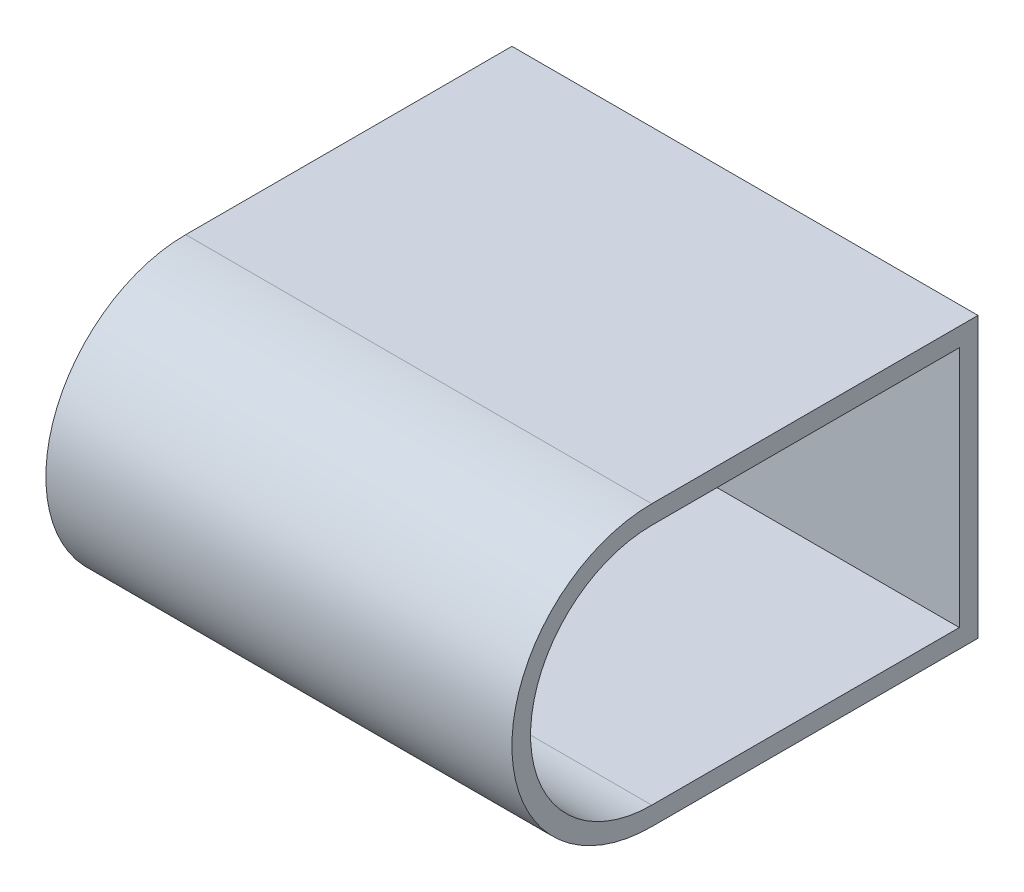
ISO-10303-21;
HEADER;
FILE_DESCRIPTION(('STEP AP214'),'2;1');
FILE_NAME('part.step','',(''),(''),'','','');
FILE_SCHEMA(('AUTOMOTIVE_DESIGN { 1 0 10303 214 1 1 1 1 }'));
ENDSEC;
DATA;
#1=APPLICATION_CONTEXT('core data for automotive mechanical design processes');
#2=APPLICATION_PROTOCOL_DEFINITION('international standard','automotive_design',2000,#1);
#3=PRODUCT_CONTEXT('',#1,'mechanical');
#4=PRODUCT('Part','Part','',(#3));
#5=PRODUCT_RELATED_PRODUCT_CATEGORY('part','',(#4));
#6=PRODUCT_DEFINITION_FORMATION('','',#4);
#7=PRODUCT_DEFINITION_CONTEXT('part definition',#1,'design');
#8=PRODUCT_DEFINITION('design','',#6,#7);
#9=PRODUCT_DEFINITION_SHAPE('','',#8);
#10=(LENGTH_UNIT() NAMED_UNIT(*) SI_UNIT(.MILLI.,.METRE.));
#11=(NAMED_UNIT(*) PLANE_ANGLE_UNIT() SI_UNIT($,.RADIAN.));
#12=(NAMED_UNIT(*) SI_UNIT($,.STERADIAN.) SOLID_ANGLE_UNIT());
#13=UNCERTAINTY_MEASURE_WITH_UNIT(LENGTH_MEASURE(1.E-05),#10,'distance_accuracy_value','');
#14=(GEOMETRIC_REPRESENTATION_CONTEXT(3) GLOBAL_UNCERTAINTY_ASSIGNED_CONTEXT((#13)) GLOBAL_UNIT_ASSIGNED_CONTEXT((#10,
#11,#12)) REPRESENTATION_CONTEXT('',''));
#15=CARTESIAN_POINT('',(0.,0.,0.));
#16=DIRECTION('',(0.,0.,1.));
#17=DIRECTION('',(1.,0.,0.));
#18=AXIS2_PLACEMENT_3D('',#15,#16,#17);
#19=CARTESIAN_POINT('',(2.,0.,35.));
#20=DIRECTION('',(-1.,0.,0.));
#21=DIRECTION('',(0.,0.,1.));
#22=AXIS2_PLACEMENT_3D('',#19,#20,#21);
#23=CYLINDRICAL_SURFACE('',#22,13.);
#24=CARTESIAN_POINT('',(0.,0.,35.));
#25=DIRECTION('',(-1.,0.,0.));
#26=DIRECTION('',(0.,0.,1.));
#27=AXIS2_PLACEMENT_3D('',#24,#25,#26);
#28=CIRCLE('',#27,13.);
#29=CARTESIAN_POINT('',(0.,-13.,35.));
#30=VERTEX_POINT('',#29);
#31=CARTESIAN_POINT('',(0.,13.,35.));
#32=VERTEX_POINT('',#31);
#33=EDGE_CURVE('E124',#30,#32,#28,.T.);
#34=ORIENTED_EDGE('',*,*,#33,.F.);
#35=DIRECTION('',(-1.,0.,0.));
#36=VECTOR('',#35,1.);
#37=CARTESIAN_POINT('',(2.,-13.,35.));
#38=LINE('',#37,#36);
#39=CARTESIAN_POINT('',(2.,-13.,35.));
#40=VERTEX_POINT('',#39);
#41=EDGE_CURVE('E13',#40,#30,#38,.T.);
#42=ORIENTED_EDGE('',*,*,#41,.F.);
#43=CARTESIAN_POINT('',(2.,0.,35.));
#44=DIRECTION('',(-1.,0.,0.));
#45=DIRECTION('',(0.,0.,1.));
#46=AXIS2_PLACEMENT_3D('',#43,#44,#45);
#47=CIRCLE('',#46,13.);
#48=CARTESIAN_POINT('',(2.,13.,35.));
#49=VERTEX_POINT('',#48);
#50=EDGE_CURVE('E117',#40,#49,#47,.T.);
#51=ORIENTED_EDGE('',*,*,#50,.T.);
#52=DIRECTION('',(-1.,0.,0.));
#53=VECTOR('',#52,1.);
#54=CARTESIAN_POINT('',(2.,13.,35.));
#55=LINE('',#54,#53);
#56=EDGE_CURVE('E62',#49,#32,#55,.T.);
#57=ORIENTED_EDGE('',*,*,#56,.T.);
#58=EDGE_LOOP('',(#34,#42,#51,#57));
#59=FACE_BOUND('',#58,.T.);
#60=ADVANCED_FACE('F59',(#59),#23,.T.);
#61=CARTESIAN_POINT('',(2.,-13.,35.));
#62=DIRECTION('',(0.,-1.,0.));
#63=DIRECTION('',(0.,0.,-1.));
#64=AXIS2_PLACEMENT_3D('',#61,#62,#63);
#65=PLANE('',#64);
#66=DIRECTION('',(0.,0.,1.));
#67=VECTOR('',#66,1.);
#68=CARTESIAN_POINT('',(0.,-13.,35.));
#69=LINE('',#68,#67);
#70=CARTESIAN_POINT('',(0.,-13.,2.));
#71=VERTEX_POINT('',#70);
#72=EDGE_CURVE('E119',#71,#30,#69,.T.);
#73=ORIENTED_EDGE('',*,*,#72,.F.);
#74=DIRECTION('',(-1.,0.,0.));
#75=VECTOR('',#74,1.);
#76=CARTESIAN_POINT('',(2.,-13.,2.));
#77=LINE('',#76,#75);
#78=CARTESIAN_POINT('',(2.,-13.,2.));
#79=VERTEX_POINT('',#78);
#80=EDGE_CURVE('E68',#79,#71,#77,.T.);
#81=ORIENTED_EDGE('',*,*,#80,.F.);
#82=DIRECTION('',(0.,0.,1.));
#83=VECTOR('',#82,1.);
#84=CARTESIAN_POINT('',(2.,-13.,35.));
#85=LINE('',#84,#83);
#86=EDGE_CURVE('E114',#79,#40,#85,.T.);
#87=ORIENTED_EDGE('',*,*,#86,.T.);
#88=ORIENTED_EDGE('',*,*,#41,.T.);
#89=EDGE_LOOP('',(#73,#81,#87,#88));
#90=FACE_BOUND('',#89,.T.);
#91=ADVANCED_FACE('F135',(#90),#65,.T.);
#92=CARTESIAN_POINT('',(2.,-13.,2.));
#93=DIRECTION('',(0.,0.,-1.));
#94=DIRECTION('',(-1.,0.,0.));
#95=AXIS2_PLACEMENT_3D('',#92,#93,#94);
#96=PLANE('',#95);
#97=DIRECTION('',(0.,-1.,0.));
#98=VECTOR('',#97,1.);
#99=CARTESIAN_POINT('',(0.,-13.,2.));
#100=LINE('',#99,#98);
#101=CARTESIAN_POINT('',(0.,13.,2.));
#102=VERTEX_POINT('',#101);
#103=EDGE_CURVE('E109',#102,#71,#100,.T.);
#104=ORIENTED_EDGE('',*,*,#103,.F.);
#105=DIRECTION('',(-1.,0.,0.));
#106=VECTOR('',#105,1.);
#107=CARTESIAN_POINT('',(2.,13.,2.));
#108=LINE('',#107,#106);
#109=CARTESIAN_POINT('',(2.,13.,2.));
#110=VERTEX_POINT('',#109);
#111=EDGE_CURVE('E104',#110,#102,#108,.T.);
#112=ORIENTED_EDGE('',*,*,#111,.F.);
#113=DIRECTION('',(0.,-1.,0.));
#114=VECTOR('',#113,1.);
#115=CARTESIAN_POINT('',(2.,-13.,2.));
#116=LINE('',#115,#114);
#117=EDGE_CURVE('E107',#110,#79,#116,.T.);
#118=ORIENTED_EDGE('',*,*,#117,.T.);
#119=ORIENTED_EDGE('',*,*,#80,.T.);
#120=EDGE_LOOP('',(#104,#112,#118,#119));
#121=FACE_BOUND('',#120,.T.);
#122=ADVANCED_FACE('F106',(#121),#96,.T.);
#123=CARTESIAN_POINT('',(2.,13.,2.));
#124=DIRECTION('',(0.,1.,0.));
#125=DIRECTION('',(0.,0.,1.));
#126=AXIS2_PLACEMENT_3D('',#123,#124,#125);
#127=PLANE('',#126);
#128=DIRECTION('',(0.,0.,-1.));
#129=VECTOR('',#128,1.);
#130=CARTESIAN_POINT('',(0.,13.,2.));
#131=LINE('',#130,#129);
#132=EDGE_CURVE('E127',#32,#102,#131,.T.);
#133=ORIENTED_EDGE('',*,*,#132,.F.);
#134=ORIENTED_EDGE('',*,*,#56,.F.);
#135=DIRECTION('',(0.,0.,-1.));
#136=VECTOR('',#135,1.);
#137=CARTESIAN_POINT('',(2.,13.,2.));
#138=LINE('',#137,#136);
#139=EDGE_CURVE('E113',#49,#110,#138,.T.);
#140=ORIENTED_EDGE('',*,*,#139,.T.);
#141=ORIENTED_EDGE('',*,*,#111,.T.);
#142=EDGE_LOOP('',(#133,#134,#140,#141));
#143=FACE_BOUND('',#142,.T.);
#144=ADVANCED_FACE('F116',(#143),#127,.T.);
#145=CARTESIAN_POINT('',(2.,0.,35.));
#146=DIRECTION('',(-1.,0.,0.));
#147=DIRECTION('',(0.,0.,1.));
#148=AXIS2_PLACEMENT_3D('',#145,#146,#147);
#149=PLANE('',#148);
#150=CARTESIAN_POINT('',(2.,0.,35.));
#151=DIRECTION('',(-1.,0.,0.));
#152=DIRECTION('',(0.,0.,1.));
#153=AXIS2_PLACEMENT_3D('',#150,#151,#152);
#154=CIRCLE('',#153,5.);
#155=CARTESIAN_POINT('',(2.,0.,40.));
#156=VERTEX_POINT('',#155);
#157=EDGE_CURVE('E128',#156,#156,#154,.T.);
#158=ORIENTED_EDGE('',*,*,#157,.T.);
#159=EDGE_LOOP('',(#158));
#160=FACE_BOUND('',#159,.T.);
#161=ORIENTED_EDGE('',*,*,#50,.F.);
#162=ORIENTED_EDGE('',*,*,#86,.F.);
#163=ORIENTED_EDGE('',*,*,#117,.F.);
#164=ORIENTED_EDGE('',*,*,#139,.F.);
#165=EDGE_LOOP('',(#161,#162,#163,#164));
#166=FACE_BOUND('',#165,.T.);
#167=ADVANCED_FACE('F112',(#160,#166),#149,.F.);
#168=CARTESIAN_POINT('',(0.,0.,35.));
#169=DIRECTION('',(-1.,0.,0.));
#170=DIRECTION('',(0.,0.,1.));
#171=AXIS2_PLACEMENT_3D('',#168,#169,#170);
#172=PLANE('',#171);
#173=CARTESIAN_POINT('',(0.,0.,35.));
#174=DIRECTION('',(-1.,0.,0.));
#175=DIRECTION('',(0.,0.,1.));
#176=AXIS2_PLACEMENT_3D('',#173,#174,#175);
#177=CIRCLE('',#176,5.);
#178=CARTESIAN_POINT('',(0.,0.,40.));
#179=VERTEX_POINT('',#178);
#180=EDGE_CURVE('E165',#179,#179,#177,.T.);
#181=ORIENTED_EDGE('',*,*,#180,.F.);
#182=EDGE_LOOP('',(#181));
#183=FACE_BOUND('',#182,.T.);
#184=ORIENTED_EDGE('',*,*,#33,.T.);
#185=ORIENTED_EDGE('',*,*,#132,.T.);
#186=ORIENTED_EDGE('',*,*,#103,.T.);
#187=ORIENTED_EDGE('',*,*,#72,.T.);
#188=EDGE_LOOP('',(#184,#185,#186,#187));
#189=FACE_BOUND('',#188,.T.);
#190=ADVANCED_FACE('F134',(#183,#189),#172,.T.);
#191=CARTESIAN_POINT('',(2.,0.,35.));
#192=DIRECTION('',(-1.,0.,0.));
#193=DIRECTION('',(0.,0.,1.));
#194=AXIS2_PLACEMENT_3D('',#191,#192,#193);
#195=CYLINDRICAL_SURFACE('',#194,5.);
#196=ORIENTED_EDGE('',*,*,#157,.F.);
#197=EDGE_LOOP('',(#196));
#198=FACE_BOUND('',#197,.T.);
#199=ORIENTED_EDGE('',*,*,#180,.T.);
#200=EDGE_LOOP('',(#199));
#201=FACE_BOUND('',#200,.T.);
#202=ADVANCED_FACE('F153',(#198,#201),#195,.F.);
#203=CLOSED_SHELL('',(#60,#91,#122,#144,#167,#190,#202));
#204=MANIFOLD_SOLID_BREP('B2',#203);
#205=CARTESIAN_POINT('',(50.,13.,2.));
#206=DIRECTION('',(0.,0.,1.));
#207=DIRECTION('',(1.,0.,0.));
#208=AXIS2_PLACEMENT_3D('',#205,#206,#207);
#209=PLANE('',#208);
#210=DIRECTION('',(0.,1.,0.));
#211=VECTOR('',#210,1.);
#212=CARTESIAN_POINT('',(0.,13.,2.));
#213=LINE('',#212,#211);
#214=CARTESIAN_POINT('',(0.,-13.,2.));
#215=VERTEX_POINT('',#214);
#216=CARTESIAN_POINT('',(0.,13.,2.));
#217=VERTEX_POINT('',#216);
#218=EDGE_CURVE('E310',#215,#217,#213,.T.);
#219=ORIENTED_EDGE('',*,*,#218,.F.);
#220=DIRECTION('',(-1.,0.,0.));
#221=VECTOR('',#220,1.);
#222=CARTESIAN_POINT('',(50.,-13.,2.));
#223=LINE('',#222,#221);
#224=CARTESIAN_POINT('',(50.,-13.,2.));
#225=VERTEX_POINT('',#224);
#226=EDGE_CURVE('E57',#225,#215,#223,.T.);
#227=ORIENTED_EDGE('',*,*,#226,.F.);
#228=DIRECTION('',(0.,1.,0.));
#229=VECTOR('',#228,1.);
#230=CARTESIAN_POINT('',(50.,13.,2.));
#231=LINE('',#230,#229);
#232=CARTESIAN_POINT('',(50.,13.,2.));
#233=VERTEX_POINT('',#232);
#234=EDGE_CURVE('E292',#225,#233,#231,.T.);
#235=ORIENTED_EDGE('',*,*,#234,.T.);
#236=DIRECTION('',(-1.,0.,0.));
#237=VECTOR('',#236,1.);
#238=CARTESIAN_POINT('',(50.,13.,2.));
#239=LINE('',#238,#237);
#240=EDGE_CURVE('E223',#233,#217,#239,.T.);
#241=ORIENTED_EDGE('',*,*,#240,.T.);
#242=EDGE_LOOP('',(#219,#227,#235,#241));
#243=FACE_BOUND('',#242,.T.);
#244=ADVANCED_FACE('F204',(#243),#209,.T.);
#245=CARTESIAN_POINT('',(50.,-13.,2.));
#246=DIRECTION('',(0.,1.,0.));
#247=DIRECTION('',(0.,0.,1.));
#248=AXIS2_PLACEMENT_3D('',#245,#246,#247);
#249=PLANE('',#248);
#250=DIRECTION('',(0.,0.,-1.));
#251=VECTOR('',#250,1.);
#252=CARTESIAN_POINT('',(0.,-13.,2.));
#253=LINE('',#252,#251);
#254=CARTESIAN_POINT('',(0.,-13.,35.));
#255=VERTEX_POINT('',#254);
#256=EDGE_CURVE('E281',#255,#215,#253,.T.);
#257=ORIENTED_EDGE('',*,*,#256,.F.);
#258=DIRECTION('',(-1.,0.,0.));
#259=VECTOR('',#258,1.);
#260=CARTESIAN_POINT('',(50.,-13.,35.));
#261=LINE('',#260,#259);
#262=CARTESIAN_POINT('',(50.,-13.,35.));
#263=VERTEX_POINT('',#262);
#264=EDGE_CURVE('E214',#263,#255,#261,.T.);
#265=ORIENTED_EDGE('',*,*,#264,.F.);
#266=DIRECTION('',(0.,0.,-1.));
#267=VECTOR('',#266,1.);
#268=CARTESIAN_POINT('',(50.,-13.,2.));
#269=LINE('',#268,#267);
#270=EDGE_CURVE('E279',#263,#225,#269,.T.);
#271=ORIENTED_EDGE('',*,*,#270,.T.);
#272=ORIENTED_EDGE('',*,*,#226,.T.);
#273=EDGE_LOOP('',(#257,#265,#271,#272));
#274=FACE_BOUND('',#273,.T.);
#275=ADVANCED_FACE('F278',(#274),#249,.T.);
#276=CARTESIAN_POINT('',(50.,0.,35.));
#277=DIRECTION('',(-1.,0.,0.));
#278=DIRECTION('',(0.,0.,1.));
#279=AXIS2_PLACEMENT_3D('',#276,#277,#278);
#280=CYLINDRICAL_SURFACE('',#279,13.);
#281=CARTESIAN_POINT('',(0.,0.,35.));
#282=DIRECTION('',(1.,0.,0.));
#283=DIRECTION('',(0.,0.,1.));
#284=AXIS2_PLACEMENT_3D('',#281,#282,#283);
#285=CIRCLE('',#284,13.);
#286=CARTESIAN_POINT('',(0.,13.,35.));
#287=VERTEX_POINT('',#286);
#288=EDGE_CURVE('E313',#287,#255,#285,.T.);
#289=ORIENTED_EDGE('',*,*,#288,.F.);
#290=DIRECTION('',(-1.,0.,0.));
#291=VECTOR('',#290,1.);
#292=CARTESIAN_POINT('',(50.,13.,35.));
#293=LINE('',#292,#291);
#294=CARTESIAN_POINT('',(50.,13.,35.));
#295=VERTEX_POINT('',#294);
#296=EDGE_CURVE('E248',#295,#287,#293,.T.);
#297=ORIENTED_EDGE('',*,*,#296,.F.);
#298=CARTESIAN_POINT('',(50.,0.,35.));
#299=DIRECTION('',(1.,0.,0.));
#300=DIRECTION('',(0.,0.,1.));
#301=AXIS2_PLACEMENT_3D('',#298,#299,#300);
#302=CIRCLE('',#301,13.);
#303=EDGE_CURVE('E291',#295,#263,#302,.T.);
#304=ORIENTED_EDGE('',*,*,#303,.T.);
#305=ORIENTED_EDGE('',*,*,#264,.T.);
#306=EDGE_LOOP('',(#289,#297,#304,#305));
#307=FACE_BOUND('',#306,.T.);
#308=ADVANCED_FACE('F294',(#307),#280,.F.);
#309=CARTESIAN_POINT('',(50.,15.,0.));
#310=DIRECTION('',(0.,0.,1.));
#311=DIRECTION('',(1.,0.,0.));
#312=AXIS2_PLACEMENT_3D('',#309,#310,#311);
#313=PLANE('',#312);
#314=DIRECTION('',(0.,1.,0.));
#315=VECTOR('',#314,1.);
#316=CARTESIAN_POINT('',(0.,15.,0.));
#317=LINE('',#316,#315);
#318=CARTESIAN_POINT('',(0.,-15.,0.));
#319=VERTEX_POINT('',#318);
#320=CARTESIAN_POINT('',(0.,15.,0.));
#321=VERTEX_POINT('',#320);
#322=EDGE_CURVE('E301',#319,#321,#317,.T.);
#323=ORIENTED_EDGE('',*,*,#322,.T.);
#324=DIRECTION('',(-1.,0.,0.));
#325=VECTOR('',#324,1.);
#326=CARTESIAN_POINT('',(50.,15.,0.));
#327=LINE('',#326,#325);
#328=CARTESIAN_POINT('',(50.,15.,0.));
#329=VERTEX_POINT('',#328);
#330=EDGE_CURVE('E208',#329,#321,#327,.T.);
#331=ORIENTED_EDGE('',*,*,#330,.F.);
#332=DIRECTION('',(0.,1.,0.));
#333=VECTOR('',#332,1.);
#334=CARTESIAN_POINT('',(50.,15.,0.));
#335=LINE('',#334,#333);
#336=CARTESIAN_POINT('',(50.,-15.,0.));
#337=VERTEX_POINT('',#336);
#338=EDGE_CURVE('E318',#337,#329,#335,.T.);
#339=ORIENTED_EDGE('',*,*,#338,.F.);
#340=DIRECTION('',(-1.,0.,0.));
#341=VECTOR('',#340,1.);
#342=CARTESIAN_POINT('',(50.,-15.,0.));
#343=LINE('',#342,#341);
#344=EDGE_CURVE('E297',#337,#319,#343,.T.);
#345=ORIENTED_EDGE('',*,*,#344,.T.);
#346=EDGE_LOOP('',(#323,#331,#339,#345));
#347=FACE_BOUND('',#346,.T.);
#348=ADVANCED_FACE('F206',(#347),#313,.F.);
#349=CARTESIAN_POINT('',(50.,15.,35.));
#350=DIRECTION('',(0.,-1.,0.));
#351=DIRECTION('',(0.,0.,-1.));
#352=AXIS2_PLACEMENT_3D('',#349,#350,#351);
#353=PLANE('',#352);
#354=DIRECTION('',(0.,0.,1.));
#355=VECTOR('',#354,1.);
#356=CARTESIAN_POINT('',(0.,15.,35.));
#357=LINE('',#356,#355);
#358=CARTESIAN_POINT('',(0.,15.,35.));
#359=VERTEX_POINT('',#358);
#360=EDGE_CURVE('E304',#321,#359,#357,.T.);
#361=ORIENTED_EDGE('',*,*,#360,.T.);
#362=DIRECTION('',(-1.,0.,0.));
#363=VECTOR('',#362,1.);
#364=CARTESIAN_POINT('',(50.,15.,35.));
#365=LINE('',#364,#363);
#366=CARTESIAN_POINT('',(50.,15.,35.));
#367=VERTEX_POINT('',#366);
#368=EDGE_CURVE('E325',#367,#359,#365,.T.);
#369=ORIENTED_EDGE('',*,*,#368,.F.);
#370=DIRECTION('',(0.,0.,1.));
#371=VECTOR('',#370,1.);
#372=CARTESIAN_POINT('',(50.,15.,35.));
#373=LINE('',#372,#371);
#374=EDGE_CURVE('E261',#329,#367,#373,.T.);
#375=ORIENTED_EDGE('',*,*,#374,.F.);
#376=ORIENTED_EDGE('',*,*,#330,.T.);
#377=EDGE_LOOP('',(#361,#369,#375,#376));
#378=FACE_BOUND('',#377,.T.);
#379=ADVANCED_FACE('F331',(#378),#353,.F.);
#380=CARTESIAN_POINT('',(50.,0.,35.));
#381=DIRECTION('',(-1.,0.,0.));
#382=DIRECTION('',(0.,0.,1.));
#383=AXIS2_PLACEMENT_3D('',#380,#381,#382);
#384=CYLINDRICAL_SURFACE('',#383,15.);
#385=CARTESIAN_POINT('',(0.,0.,35.));
#386=DIRECTION('',(1.,0.,0.));
#387=DIRECTION('',(0.,0.,1.));
#388=AXIS2_PLACEMENT_3D('',#385,#386,#387);
#389=CIRCLE('',#388,15.);
#390=CARTESIAN_POINT('',(0.,-15.,35.));
#391=VERTEX_POINT('',#390);
#392=EDGE_CURVE('E306',#359,#391,#389,.T.);
#393=ORIENTED_EDGE('',*,*,#392,.T.);
#394=DIRECTION('',(-1.,0.,0.));
#395=VECTOR('',#394,1.);
#396=CARTESIAN_POINT('',(50.,-15.,35.));
#397=LINE('',#396,#395);
#398=CARTESIAN_POINT('',(50.,-15.,35.));
#399=VERTEX_POINT('',#398);
#400=EDGE_CURVE('E323',#399,#391,#397,.T.);
#401=ORIENTED_EDGE('',*,*,#400,.F.);
#402=CARTESIAN_POINT('',(50.,0.,35.));
#403=DIRECTION('',(1.,0.,0.));
#404=DIRECTION('',(0.,0.,1.));
#405=AXIS2_PLACEMENT_3D('',#402,#403,#404);
#406=CIRCLE('',#405,15.);
#407=EDGE_CURVE('E347',#367,#399,#406,.T.);
#408=ORIENTED_EDGE('',*,*,#407,.F.);
#409=ORIENTED_EDGE('',*,*,#368,.T.);
#410=EDGE_LOOP('',(#393,#401,#408,#409));
#411=FACE_BOUND('',#410,.T.);
#412=ADVANCED_FACE('F341',(#411),#384,.T.);
#413=CARTESIAN_POINT('',(50.,-15.,0.));
#414=DIRECTION('',(0.,1.,0.));
#415=DIRECTION('',(0.,0.,1.));
#416=AXIS2_PLACEMENT_3D('',#413,#414,#415);
#417=PLANE('',#416);
#418=DIRECTION('',(0.,0.,-1.));
#419=VECTOR('',#418,1.);
#420=CARTESIAN_POINT('',(0.,-15.,0.));
#421=LINE('',#420,#419);
#422=EDGE_CURVE('E308',#391,#319,#421,.T.);
#423=ORIENTED_EDGE('',*,*,#422,.T.);
#424=ORIENTED_EDGE('',*,*,#344,.F.);
#425=DIRECTION('',(0.,0.,-1.));
#426=VECTOR('',#425,1.);
#427=CARTESIAN_POINT('',(50.,-15.,0.));
#428=LINE('',#427,#426);
#429=EDGE_CURVE('E345',#399,#337,#428,.T.);
#430=ORIENTED_EDGE('',*,*,#429,.F.);
#431=ORIENTED_EDGE('',*,*,#400,.T.);
#432=EDGE_LOOP('',(#423,#424,#430,#431));
#433=FACE_BOUND('',#432,.T.);
#434=ADVANCED_FACE('F344',(#433),#417,.F.);
#435=CARTESIAN_POINT('',(50.,13.,35.));
#436=DIRECTION('',(0.,-1.,0.));
#437=DIRECTION('',(0.,0.,-1.));
#438=AXIS2_PLACEMENT_3D('',#435,#436,#437);
#439=PLANE('',#438);
#440=DIRECTION('',(0.,0.,1.));
#441=VECTOR('',#440,1.);
#442=CARTESIAN_POINT('',(0.,13.,35.));
#443=LINE('',#442,#441);
#444=EDGE_CURVE('E315',#217,#287,#443,.T.);
#445=ORIENTED_EDGE('',*,*,#444,.F.);
#446=ORIENTED_EDGE('',*,*,#240,.F.);
#447=DIRECTION('',(0.,0.,1.));
#448=VECTOR('',#447,1.);
#449=CARTESIAN_POINT('',(50.,13.,35.));
#450=LINE('',#449,#448);
#451=EDGE_CURVE('E295',#233,#295,#450,.T.);
#452=ORIENTED_EDGE('',*,*,#451,.T.);
#453=ORIENTED_EDGE('',*,*,#296,.T.);
#454=EDGE_LOOP('',(#445,#446,#452,#453));
#455=FACE_BOUND('',#454,.T.);
#456=ADVANCED_FACE('F353',(#455),#439,.T.);
#457=CARTESIAN_POINT('',(50.,0.,35.));
#458=DIRECTION('',(-1.,0.,0.));
#459=DIRECTION('',(0.,0.,1.));
#460=AXIS2_PLACEMENT_3D('',#457,#458,#459);
#461=PLANE('',#460);
#462=ORIENTED_EDGE('',*,*,#338,.T.);
#463=ORIENTED_EDGE('',*,*,#374,.T.);
#464=ORIENTED_EDGE('',*,*,#407,.T.);
#465=ORIENTED_EDGE('',*,*,#429,.T.);
#466=EDGE_LOOP('',(#462,#463,#464,#465));
#467=FACE_BOUND('',#466,.T.);
#468=ORIENTED_EDGE('',*,*,#234,.F.);
#469=ORIENTED_EDGE('',*,*,#270,.F.);
#470=ORIENTED_EDGE('',*,*,#303,.F.);
#471=ORIENTED_EDGE('',*,*,#451,.F.);
#472=EDGE_LOOP('',(#468,#469,#470,#471));
#473=FACE_BOUND('',#472,.T.);
#474=ADVANCED_FACE('F289',(#467,#473),#461,.F.);
#475=CARTESIAN_POINT('',(0.,0.,35.));
#476=DIRECTION('',(-1.,0.,0.));
#477=DIRECTION('',(0.,0.,1.));
#478=AXIS2_PLACEMENT_3D('',#475,#476,#477);
#479=PLANE('',#478);
#480=ORIENTED_EDGE('',*,*,#322,.F.);
#481=ORIENTED_EDGE('',*,*,#422,.F.);
#482=ORIENTED_EDGE('',*,*,#392,.F.);
#483=ORIENTED_EDGE('',*,*,#360,.F.);
#484=EDGE_LOOP('',(#480,#481,#482,#483));
#485=FACE_BOUND('',#484,.T.);
#486=ORIENTED_EDGE('',*,*,#218,.T.);
#487=ORIENTED_EDGE('',*,*,#444,.T.);
#488=ORIENTED_EDGE('',*,*,#288,.T.);
#489=ORIENTED_EDGE('',*,*,#256,.T.);
#490=EDGE_LOOP('',(#486,#487,#488,#489));
#491=FACE_BOUND('',#490,.T.);
#492=ADVANCED_FACE('F338',(#485,#491),#479,.T.);
#493=CLOSED_SHELL('',(#244,#275,#308,#348,#379,#412,#434,#456,#474,#492));
#494=MANIFOLD_SOLID_BREP('B7',#493);
#495=ADVANCED_BREP_SHAPE_REPRESENTATION('',(#18,#204,#494),#14);
#496=SHAPE_DEFINITION_REPRESENTATION(#9,#495);
ENDSEC;
END-ISO-10303-21;
